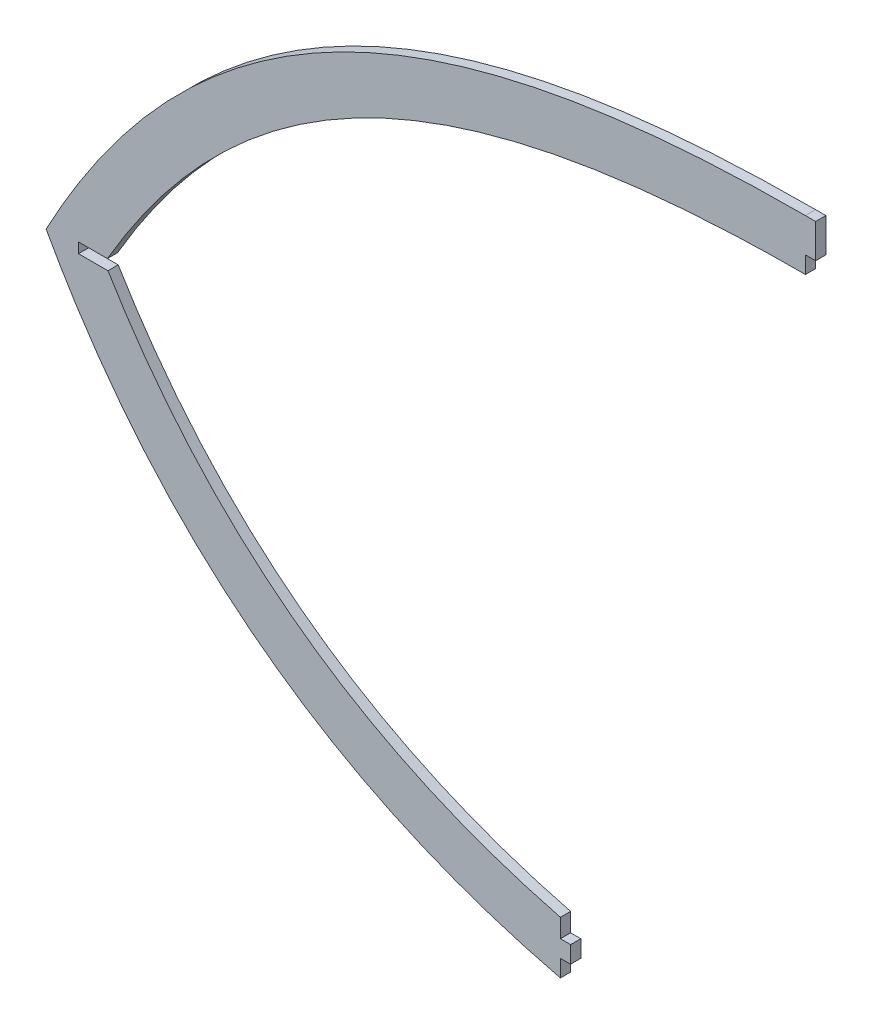
ISO-10303-21;
HEADER;
FILE_DESCRIPTION(('STEP AP214'),'2;1');
FILE_NAME('part.step','',(''),(''),'','','');
FILE_SCHEMA(('AUTOMOTIVE_DESIGN { 1 0 10303 214 1 1 1 1 }'));
ENDSEC;
DATA;
#1=APPLICATION_CONTEXT('core data for automotive mechanical design processes');
#2=APPLICATION_PROTOCOL_DEFINITION('international standard','automotive_design',2000,#1);
#3=PRODUCT_CONTEXT('',#1,'mechanical');
#4=PRODUCT('Part','Part','',(#3));
#5=PRODUCT_RELATED_PRODUCT_CATEGORY('part','',(#4));
#6=PRODUCT_DEFINITION_FORMATION('','',#4);
#7=PRODUCT_DEFINITION_CONTEXT('part definition',#1,'design');
#8=PRODUCT_DEFINITION('design','',#6,#7);
#9=PRODUCT_DEFINITION_SHAPE('','',#8);
#10=(LENGTH_UNIT() NAMED_UNIT(*) SI_UNIT(.MILLI.,.METRE.));
#11=(NAMED_UNIT(*) PLANE_ANGLE_UNIT() SI_UNIT($,.RADIAN.));
#12=(NAMED_UNIT(*) SI_UNIT($,.STERADIAN.) SOLID_ANGLE_UNIT());
#13=UNCERTAINTY_MEASURE_WITH_UNIT(LENGTH_MEASURE(1.E-05),#10,'distance_accuracy_value','');
#14=(GEOMETRIC_REPRESENTATION_CONTEXT(3) GLOBAL_UNCERTAINTY_ASSIGNED_CONTEXT((#13)) GLOBAL_UNIT_ASSIGNED_CONTEXT((#10,
#11,#12)) REPRESENTATION_CONTEXT('',''));
#15=CARTESIAN_POINT('',(0.,0.,0.));
#16=DIRECTION('',(0.,0.,1.));
#17=DIRECTION('',(1.,0.,0.));
#18=AXIS2_PLACEMENT_3D('',#15,#16,#17);
#19=CARTESIAN_POINT('',(-82.9999999999987,160.499999999998,1.5));
#20=DIRECTION('',(3.51570624464633E-13,1.,0.));
#21=DIRECTION('',(-1.,3.51570624464633E-13,0.));
#22=AXIS2_PLACEMENT_3D('',#19,#20,#21);
#23=PLANE('',#22);
#24=DIRECTION('',(1.,-3.51570624464633E-13,0.));
#25=VECTOR('',#24,1.);
#26=CARTESIAN_POINT('',(-82.9999999999987,160.499999999998,-1.5));
#27=LINE('',#26,#25);
#28=CARTESIAN_POINT('',(-82.9999999999987,160.499999999998,-1.5));
#29=VERTEX_POINT('',#28);
#30=CARTESIAN_POINT('',(-79.9999999999987,160.499999999996,-1.5));
#31=VERTEX_POINT('',#30);
#32=EDGE_CURVE('E317',#29,#31,#27,.T.);
#33=ORIENTED_EDGE('',*,*,#32,.F.);
#34=DIRECTION('',(0.,0.,-1.));
#35=VECTOR('',#34,1.);
#36=CARTESIAN_POINT('',(-82.9999999999987,160.499999999998,1.5));
#37=LINE('',#36,#35);
#38=CARTESIAN_POINT('',(-82.9999999999987,160.499999999998,1.5));
#39=VERTEX_POINT('',#38);
#40=EDGE_CURVE('E11',#39,#29,#37,.T.);
#41=ORIENTED_EDGE('',*,*,#40,.F.);
#42=DIRECTION('',(1.,-3.51570624464633E-13,0.));
#43=VECTOR('',#42,1.);
#44=CARTESIAN_POINT('',(-82.9999999999987,160.499999999998,1.5));
#45=LINE('',#44,#43);
#46=CARTESIAN_POINT('',(-79.9999999999987,160.499999999996,1.5));
#47=VERTEX_POINT('',#46);
#48=EDGE_CURVE('E367',#39,#47,#45,.T.);
#49=ORIENTED_EDGE('',*,*,#48,.T.);
#50=DIRECTION('',(0.,0.,-1.));
#51=VECTOR('',#50,1.);
#52=CARTESIAN_POINT('',(-79.9999999999987,160.499999999996,1.5));
#53=LINE('',#52,#51);
#54=EDGE_CURVE('E39',#47,#31,#53,.T.);
#55=ORIENTED_EDGE('',*,*,#54,.T.);
#56=EDGE_LOOP('',(#33,#41,#49,#55));
#57=FACE_BOUND('',#56,.T.);
#58=ADVANCED_FACE('F36',(#57),#23,.T.);
#59=CARTESIAN_POINT('',(-82.9999999999987,160.499999999998,1.5));
#60=CARTESIAN_POINT('',(-186.674882327718,160.499999999998,1.5));
#61=CARTESIAN_POINT('',(-259.899625942539,132.369993049377,1.5));
#62=CARTESIAN_POINT('',(-306.089272366091,45.5,1.5));
#63=B_SPLINE_CURVE_WITH_KNOTS('',3,(#59,#60,#61,#62),.UNSPECIFIED.,.F.,.F.,(4,4),(0.,1.),.UNSPECIFIED.);
#64=DIRECTION('',(0.,0.,-1.));
#65=VECTOR('',#64,1.);
#66=SURFACE_OF_LINEAR_EXTRUSION('',#63,#65);
#67=CARTESIAN_POINT('',(-82.9999999999987,160.499999999998,-1.5));
#68=CARTESIAN_POINT('',(-186.674882327718,160.499999999998,-1.5));
#69=CARTESIAN_POINT('',(-259.899625942539,132.369993049377,-1.5));
#70=CARTESIAN_POINT('',(-306.089272366091,45.5,-1.5));
#71=B_SPLINE_CURVE_WITH_KNOTS('',3,(#67,#68,#69,#70),.UNSPECIFIED.,.F.,.F.,(4,4),(0.,1.),.UNSPECIFIED.);
#72=CARTESIAN_POINT('',(-306.089272366091,45.5,-1.5));
#73=VERTEX_POINT('',#72);
#74=EDGE_CURVE('E361',#29,#73,#71,.T.);
#75=ORIENTED_EDGE('',*,*,#74,.T.);
#76=DIRECTION('',(0.,0.,-1.));
#77=VECTOR('',#76,1.);
#78=CARTESIAN_POINT('',(-306.089272366091,45.5,1.5));
#79=LINE('',#78,#77);
#80=CARTESIAN_POINT('',(-306.089272366091,45.5,1.5));
#81=VERTEX_POINT('',#80);
#82=EDGE_CURVE('E45',#81,#73,#79,.T.);
#83=ORIENTED_EDGE('',*,*,#82,.F.);
#84=EDGE_CURVE('E174',#39,#81,#63,.T.);
#85=ORIENTED_EDGE('',*,*,#84,.F.);
#86=ORIENTED_EDGE('',*,*,#40,.T.);
#87=EDGE_LOOP('',(#75,#83,#85,#86));
#88=FACE_BOUND('',#87,.T.);
#89=ADVANCED_FACE('F192',(#88),#66,.F.);
#90=CARTESIAN_POINT('',(628121.002682427,778166.550529546,1.5));
#91=CARTESIAN_POINT('',(-612218.711743108,-790905.456057483,1.5));
#92=CARTESIAN_POINT('',(595337.457003845,803534.153447199,1.5));
#93=B_SPLINE_CURVE_WITH_KNOTS('',2,(#90,#91,#92),.UNSPECIFIED.,.F.,.F.,(3,3),(0.,1.),.UNSPECIFIED.);
#94=DIRECTION('',(0.,0.,-1.));
#95=VECTOR('',#94,1.);
#96=SURFACE_OF_LINEAR_EXTRUSION('',#93,#95);
#97=CARTESIAN_POINT('',(628121.002682427,778166.550529546,-1.5));
#98=CARTESIAN_POINT('',(-612218.711743108,-790905.456057483,-1.5));
#99=CARTESIAN_POINT('',(595337.457003845,803534.153447199,-1.5));
#100=B_SPLINE_CURVE_WITH_KNOTS('',2,(#97,#98,#99),.UNSPECIFIED.,.F.,.F.,(3,3),(0.,1.),.UNSPECIFIED.);
#101=CARTESIAN_POINT('',(-154.999999929144,-69.5000000170487,-1.5));
#102=VERTEX_POINT('',#101);
#103=EDGE_CURVE('E159',#102,#73,#100,.T.);
#104=ORIENTED_EDGE('',*,*,#103,.F.);
#105=DIRECTION('',(0.,0.,-1.));
#106=VECTOR('',#105,1.);
#107=CARTESIAN_POINT('',(-154.999999929144,-69.5000000170487,1.5));
#108=LINE('',#107,#106);
#109=CARTESIAN_POINT('',(-154.999999929144,-69.5000000170487,1.5));
#110=VERTEX_POINT('',#109);
#111=EDGE_CURVE('E153',#110,#102,#108,.T.);
#112=ORIENTED_EDGE('',*,*,#111,.F.);
#113=EDGE_CURVE('E157',#110,#81,#93,.T.);
#114=ORIENTED_EDGE('',*,*,#113,.T.);
#115=ORIENTED_EDGE('',*,*,#82,.T.);
#116=EDGE_LOOP('',(#104,#112,#114,#115));
#117=FACE_BOUND('',#116,.T.);
#118=ADVANCED_FACE('F155',(#117),#96,.T.);
#119=CARTESIAN_POINT('',(-154.999999999998,-69.4999999999994,1.5));
#120=DIRECTION('',(-1.,1.66223645958752E-08,0.));
#121=DIRECTION('',(-1.66223645958752E-08,-1.,0.));
#122=AXIS2_PLACEMENT_3D('',#119,#120,#121);
#123=PLANE('',#122);
#124=DIRECTION('',(1.66223645958752E-08,1.,0.));
#125=VECTOR('',#124,1.);
#126=CARTESIAN_POINT('',(-154.999999999998,-69.4999999999994,-1.5));
#127=LINE('',#126,#125);
#128=CARTESIAN_POINT('',(-154.999999916886,-64.4999999999994,-1.5));
#129=VERTEX_POINT('',#128);
#130=EDGE_CURVE('E356',#102,#129,#127,.T.);
#131=ORIENTED_EDGE('',*,*,#130,.T.);
#132=DIRECTION('',(0.,0.,-1.));
#133=VECTOR('',#132,1.);
#134=CARTESIAN_POINT('',(-154.999999916886,-64.4999999999994,1.5));
#135=LINE('',#134,#133);
#136=CARTESIAN_POINT('',(-154.999999916886,-64.4999999999994,1.5));
#137=VERTEX_POINT('',#136);
#138=EDGE_CURVE('E162',#137,#129,#135,.T.);
#139=ORIENTED_EDGE('',*,*,#138,.F.);
#140=DIRECTION('',(1.66223645958752E-08,1.,0.));
#141=VECTOR('',#140,1.);
#142=CARTESIAN_POINT('',(-154.999999999998,-69.4999999999994,1.5));
#143=LINE('',#142,#141);
#144=EDGE_CURVE('E165',#110,#137,#143,.T.);
#145=ORIENTED_EDGE('',*,*,#144,.F.);
#146=ORIENTED_EDGE('',*,*,#111,.T.);
#147=EDGE_LOOP('',(#131,#139,#145,#146));
#148=FACE_BOUND('',#147,.T.);
#149=ADVANCED_FACE('F166',(#148),#123,.F.);
#150=CARTESIAN_POINT('',(-154.999999916886,-64.4999999999994,1.5));
#151=DIRECTION('',(0.,1.,0.));
#152=DIRECTION('',(-1.,0.,0.));
#153=AXIS2_PLACEMENT_3D('',#150,#151,#152);
#154=PLANE('',#153);
#155=DIRECTION('',(1.,0.,0.));
#156=VECTOR('',#155,1.);
#157=CARTESIAN_POINT('',(-154.999999916886,-64.4999999999994,-1.5));
#158=LINE('',#157,#156);
#159=CARTESIAN_POINT('',(-151.999999999998,-64.4999999999994,-1.5));
#160=VERTEX_POINT('',#159);
#161=EDGE_CURVE('E241',#129,#160,#158,.T.);
#162=ORIENTED_EDGE('',*,*,#161,.T.);
#163=DIRECTION('',(0.,0.,-1.));
#164=VECTOR('',#163,1.);
#165=CARTESIAN_POINT('',(-151.999999999998,-64.4999999999994,1.5));
#166=LINE('',#165,#164);
#167=CARTESIAN_POINT('',(-151.999999999998,-64.4999999999994,1.5));
#168=VERTEX_POINT('',#167);
#169=EDGE_CURVE('E239',#168,#160,#166,.T.);
#170=ORIENTED_EDGE('',*,*,#169,.F.);
#171=DIRECTION('',(1.,0.,0.));
#172=VECTOR('',#171,1.);
#173=CARTESIAN_POINT('',(-154.999999916886,-64.4999999999994,1.5));
#174=LINE('',#173,#172);
#175=EDGE_CURVE('E170',#137,#168,#174,.T.);
#176=ORIENTED_EDGE('',*,*,#175,.F.);
#177=ORIENTED_EDGE('',*,*,#138,.T.);
#178=EDGE_LOOP('',(#162,#170,#176,#177));
#179=FACE_BOUND('',#178,.T.);
#180=ADVANCED_FACE('F196',(#179),#154,.F.);
#181=CARTESIAN_POINT('',(-151.999999999998,-64.4999999999994,1.5));
#182=DIRECTION('',(-1.,0.,0.));
#183=DIRECTION('',(0.,-1.,0.));
#184=AXIS2_PLACEMENT_3D('',#181,#182,#183);
#185=PLANE('',#184);
#186=DIRECTION('',(0.,1.,0.));
#187=VECTOR('',#186,1.);
#188=CARTESIAN_POINT('',(-151.999999999998,-64.4999999999994,-1.5));
#189=LINE('',#188,#187);
#190=CARTESIAN_POINT('',(-151.999999999998,-59.4999999999994,-1.5));
#191=VERTEX_POINT('',#190);
#192=EDGE_CURVE('E247',#160,#191,#189,.T.);
#193=ORIENTED_EDGE('',*,*,#192,.T.);
#194=DIRECTION('',(0.,0.,-1.));
#195=VECTOR('',#194,1.);
#196=CARTESIAN_POINT('',(-151.999999999998,-59.4999999999994,1.5));
#197=LINE('',#196,#195);
#198=CARTESIAN_POINT('',(-151.999999999998,-59.4999999999994,1.5));
#199=VERTEX_POINT('',#198);
#200=EDGE_CURVE('E243',#199,#191,#197,.T.);
#201=ORIENTED_EDGE('',*,*,#200,.F.);
#202=DIRECTION('',(0.,1.,0.));
#203=VECTOR('',#202,1.);
#204=CARTESIAN_POINT('',(-151.999999999998,-64.4999999999994,1.5));
#205=LINE('',#204,#203);
#206=EDGE_CURVE('E234',#168,#199,#205,.T.);
#207=ORIENTED_EDGE('',*,*,#206,.F.);
#208=ORIENTED_EDGE('',*,*,#169,.T.);
#209=EDGE_LOOP('',(#193,#201,#207,#208));
#210=FACE_BOUND('',#209,.T.);
#211=ADVANCED_FACE('F199',(#210),#185,.F.);
#212=CARTESIAN_POINT('',(-151.999999999998,-59.4999999999994,1.5));
#213=DIRECTION('',(0.,-1.,0.));
#214=DIRECTION('',(0.,0.,-1.));
#215=AXIS2_PLACEMENT_3D('',#212,#213,#214);
#216=PLANE('',#215);
#217=DIRECTION('',(-1.,0.,0.));
#218=VECTOR('',#217,1.);
#219=CARTESIAN_POINT('',(-151.999999999998,-59.4999999999994,-1.5));
#220=LINE('',#219,#218);
#221=CARTESIAN_POINT('',(-154.999999916887,-59.4999999999994,-1.5));
#222=VERTEX_POINT('',#221);
#223=EDGE_CURVE('E352',#191,#222,#220,.T.);
#224=ORIENTED_EDGE('',*,*,#223,.T.);
#225=DIRECTION('',(0.,0.,-1.));
#226=VECTOR('',#225,1.);
#227=CARTESIAN_POINT('',(-154.999999916887,-59.4999999999994,1.5));
#228=LINE('',#227,#226);
#229=CARTESIAN_POINT('',(-154.999999916887,-59.4999999999994,1.5));
#230=VERTEX_POINT('',#229);
#231=EDGE_CURVE('E249',#230,#222,#228,.T.);
#232=ORIENTED_EDGE('',*,*,#231,.F.);
#233=DIRECTION('',(-1.,0.,0.));
#234=VECTOR('',#233,1.);
#235=CARTESIAN_POINT('',(-151.999999999998,-59.4999999999994,1.5));
#236=LINE('',#235,#234);
#237=EDGE_CURVE('E232',#199,#230,#236,.T.);
#238=ORIENTED_EDGE('',*,*,#237,.F.);
#239=ORIENTED_EDGE('',*,*,#200,.T.);
#240=EDGE_LOOP('',(#224,#232,#238,#239));
#241=FACE_BOUND('',#240,.T.);
#242=ADVANCED_FACE('F203',(#241),#216,.F.);
#243=CARTESIAN_POINT('',(-154.999999916887,-59.4999999999994,1.5));
#244=DIRECTION('',(-1.,2.80011243323957E-12,0.));
#245=DIRECTION('',(-2.80011243323957E-12,-1.,0.));
#246=AXIS2_PLACEMENT_3D('',#243,#244,#245);
#247=PLANE('',#246);
#248=DIRECTION('',(2.80011243323957E-12,1.,0.));
#249=VECTOR('',#248,1.);
#250=CARTESIAN_POINT('',(-154.999999916887,-59.4999999999994,-1.5));
#251=LINE('',#250,#249);
#252=CARTESIAN_POINT('',(-154.999999916871,-54.0482308469535,-1.5));
#253=VERTEX_POINT('',#252);
#254=EDGE_CURVE('E261',#222,#253,#251,.T.);
#255=ORIENTED_EDGE('',*,*,#254,.T.);
#256=DIRECTION('',(0.,0.,-1.));
#257=VECTOR('',#256,1.);
#258=CARTESIAN_POINT('',(-154.999999916871,-54.0482308469535,1.5));
#259=LINE('',#258,#257);
#260=CARTESIAN_POINT('',(-154.999999916871,-54.0482308469535,1.5));
#261=VERTEX_POINT('',#260);
#262=EDGE_CURVE('E259',#261,#253,#259,.T.);
#263=ORIENTED_EDGE('',*,*,#262,.F.);
#264=DIRECTION('',(2.80011243323957E-12,1.,0.));
#265=VECTOR('',#264,1.);
#266=CARTESIAN_POINT('',(-154.999999916887,-59.4999999999994,1.5));
#267=LINE('',#266,#265);
#268=EDGE_CURVE('E225',#230,#261,#267,.T.);
#269=ORIENTED_EDGE('',*,*,#268,.F.);
#270=ORIENTED_EDGE('',*,*,#231,.T.);
#271=EDGE_LOOP('',(#255,#263,#269,#270));
#272=FACE_BOUND('',#271,.T.);
#273=ADVANCED_FACE('F207',(#272),#247,.F.);
#274=CARTESIAN_POINT('',(-151.496713822991,-54.9148990615622,1.5));
#275=CARTESIAN_POINT('',(-153.398834262126,-54.4580166378309,1.5));
#276=CARTESIAN_POINT('',(-157.208567120412,-53.4984048576572,1.5));
#277=CARTESIAN_POINT('',(-164.660096697761,-51.4419935318653,1.5));
#278=CARTESIAN_POINT('',(-173.748419645787,-48.5940055598413,1.5));
#279=CARTESIAN_POINT('',(-184.26927531825,-44.7413254498893,1.5));
#280=CARTESIAN_POINT('',(-197.799833821469,-39.0240238482658,1.5));
#281=CARTESIAN_POINT('',(-213.78961101986,-30.7928618903945,1.5));
#282=CARTESIAN_POINT('',(-231.549414252278,-19.1756565135875,1.5));
#283=CARTESIAN_POINT('',(-247.929177810818,-5.79714362559889,1.5));
#284=CARTESIAN_POINT('',(-260.462024810725,6.84921209286295,1.5));
#285=CARTESIAN_POINT('',(-269.83072194683,17.8876076715245,1.5));
#286=CARTESIAN_POINT('',(-276.528937944344,26.6313311327526,1.5));
#287=CARTESIAN_POINT('',(-281.840598342277,34.3146395086273,1.5));
#288=CARTESIAN_POINT('',(-285.921125934865,40.6909740668219,1.5));
#289=CARTESIAN_POINT('',(-287.916086448758,43.974755214365,1.5));
#290=CARTESIAN_POINT('',(-288.890968436563,45.6216431758552,1.5));
#291=B_SPLINE_CURVE_WITH_KNOTS('',3,(#274,#275,#276,#277,#278,#279,#280,#281,#282,#283,#284,
#285,#286,#287,#288,#289,#290),.UNSPECIFIED.,.F.,.F.,(4,1,1,1,1,1,1,1,1,1,1,1,1,1,4),
(0.497668508711325,0.497805621376866,0.497942734042408,0.49821695937349,0.498491184704572,
0.498765410035654,0.499313860697819,0.499862311359984,0.500410762022148,0.500959212684313,
0.501233438015395,0.501507663346477,0.50178188867756,0.501919001343101,0.502056114008642),.UNSPECIFIED.);
#292=DIRECTION('',(0.,0.,-1.));
#293=VECTOR('',#292,1.);
#294=SURFACE_OF_LINEAR_EXTRUSION('',#291,#293);
#295=CARTESIAN_POINT('',(-151.496713822991,-54.9148990615622,-1.5));
#296=CARTESIAN_POINT('',(-153.398834262126,-54.4580166378309,-1.5));
#297=CARTESIAN_POINT('',(-157.208567120412,-53.4984048576572,-1.5));
#298=CARTESIAN_POINT('',(-164.660096697761,-51.4419935318653,-1.5));
#299=CARTESIAN_POINT('',(-173.748419645787,-48.5940055598413,-1.5));
#300=CARTESIAN_POINT('',(-184.26927531825,-44.7413254498893,-1.5));
#301=CARTESIAN_POINT('',(-197.799833821469,-39.0240238482658,-1.5));
#302=CARTESIAN_POINT('',(-213.78961101986,-30.7928618903945,-1.5));
#303=CARTESIAN_POINT('',(-231.549414252278,-19.1756565135875,-1.5));
#304=CARTESIAN_POINT('',(-247.929177810818,-5.79714362559889,-1.5));
#305=CARTESIAN_POINT('',(-260.462024810725,6.84921209286295,-1.5));
#306=CARTESIAN_POINT('',(-269.83072194683,17.8876076715245,-1.5));
#307=CARTESIAN_POINT('',(-276.528937944344,26.6313311327526,-1.5));
#308=CARTESIAN_POINT('',(-281.840598342277,34.3146395086273,-1.5));
#309=CARTESIAN_POINT('',(-285.921125934865,40.6909740668219,-1.5));
#310=CARTESIAN_POINT('',(-287.916086448758,43.974755214365,-1.5));
#311=CARTESIAN_POINT('',(-288.890968436563,45.6216431758552,-1.5));
#312=B_SPLINE_CURVE_WITH_KNOTS('',3,(#295,#296,#297,#298,#299,#300,#301,#302,#303,#304,#305,
#306,#307,#308,#309,#310,#311),.UNSPECIFIED.,.F.,.F.,(4,1,1,1,1,1,1,1,1,1,1,1,1,1,4),
(0.497668508711325,0.497805621376866,0.497942734042408,0.49821695937349,0.498491184704572,
0.498765410035654,0.499313860697819,0.499862311359984,0.500410762022148,0.500959212684313,
0.501233438015395,0.501507663346477,0.50178188867756,0.501919001343101,0.502056114008642),.UNSPECIFIED.);
#313=CARTESIAN_POINT('',(-287.922750115386,44.0000001015957,-1.5));
#314=VERTEX_POINT('',#313);
#315=EDGE_CURVE('E267',#253,#314,#312,.T.);
#316=ORIENTED_EDGE('',*,*,#315,.T.);
#317=DIRECTION('',(0.,0.,-1.));
#318=VECTOR('',#317,1.);
#319=CARTESIAN_POINT('',(-287.922750115386,44.0000001015957,1.5));
#320=LINE('',#319,#318);
#321=CARTESIAN_POINT('',(-287.922750115386,44.0000001015957,1.5));
#322=VERTEX_POINT('',#321);
#323=EDGE_CURVE('E264',#322,#314,#320,.T.);
#324=ORIENTED_EDGE('',*,*,#323,.F.);
#325=EDGE_CURVE('E219',#261,#322,#291,.T.);
#326=ORIENTED_EDGE('',*,*,#325,.F.);
#327=ORIENTED_EDGE('',*,*,#262,.T.);
#328=EDGE_LOOP('',(#316,#324,#326,#327));
#329=FACE_BOUND('',#328,.T.);
#330=ADVANCED_FACE('F211',(#329),#294,.F.);
#331=CARTESIAN_POINT('',(-296.59523714137,43.9999999999978,1.5));
#332=DIRECTION('',(-1.17149555039174E-08,1.,0.));
#333=DIRECTION('',(-1.,-1.17149555039174E-08,0.));
#334=AXIS2_PLACEMENT_3D('',#331,#332,#333);
#335=PLANE('',#334);
#336=DIRECTION('',(1.,1.17149555039174E-08,0.));
#337=VECTOR('',#336,1.);
#338=CARTESIAN_POINT('',(-296.59523714137,43.9999999999978,-1.5));
#339=LINE('',#338,#337);
#340=CARTESIAN_POINT('',(-296.59523714137,43.9999999999978,-1.5));
#341=VERTEX_POINT('',#340);
#342=EDGE_CURVE('E343',#341,#314,#339,.T.);
#343=ORIENTED_EDGE('',*,*,#342,.F.);
#344=DIRECTION('',(0.,0.,-1.));
#345=VECTOR('',#344,1.);
#346=CARTESIAN_POINT('',(-296.59523714137,43.9999999999978,1.5));
#347=LINE('',#346,#345);
#348=CARTESIAN_POINT('',(-296.59523714137,43.9999999999978,1.5));
#349=VERTEX_POINT('',#348);
#350=EDGE_CURVE('E271',#349,#341,#347,.T.);
#351=ORIENTED_EDGE('',*,*,#350,.F.);
#352=DIRECTION('',(1.,1.17149555039174E-08,0.));
#353=VECTOR('',#352,1.);
#354=CARTESIAN_POINT('',(-296.59523714137,43.9999999999978,1.5));
#355=LINE('',#354,#353);
#356=EDGE_CURVE('E226',#349,#322,#355,.T.);
#357=ORIENTED_EDGE('',*,*,#356,.T.);
#358=ORIENTED_EDGE('',*,*,#323,.T.);
#359=EDGE_LOOP('',(#343,#351,#357,#358));
#360=FACE_BOUND('',#359,.T.);
#361=ADVANCED_FACE('F216',(#360),#335,.T.);
#362=CARTESIAN_POINT('',(-296.59523714137,46.9999999999978,1.5));
#363=DIRECTION('',(1.,0.,0.));
#364=DIRECTION('',(0.,0.,-1.));
#365=AXIS2_PLACEMENT_3D('',#362,#363,#364);
#366=PLANE('',#365);
#367=DIRECTION('',(0.,-1.,0.));
#368=VECTOR('',#367,1.);
#369=CARTESIAN_POINT('',(-296.59523714137,46.9999999999978,-1.5));
#370=LINE('',#369,#368);
#371=CARTESIAN_POINT('',(-296.59523714137,46.9999999999978,-1.5));
#372=VERTEX_POINT('',#371);
#373=EDGE_CURVE('E340',#372,#341,#370,.T.);
#374=ORIENTED_EDGE('',*,*,#373,.F.);
#375=DIRECTION('',(0.,0.,-1.));
#376=VECTOR('',#375,1.);
#377=CARTESIAN_POINT('',(-296.59523714137,46.9999999999978,1.5));
#378=LINE('',#377,#376);
#379=CARTESIAN_POINT('',(-296.59523714137,46.9999999999978,1.5));
#380=VERTEX_POINT('',#379);
#381=EDGE_CURVE('E376',#380,#372,#378,.T.);
#382=ORIENTED_EDGE('',*,*,#381,.F.);
#383=DIRECTION('',(0.,-1.,0.));
#384=VECTOR('',#383,1.);
#385=CARTESIAN_POINT('',(-296.59523714137,46.9999999999978,1.5));
#386=LINE('',#385,#384);
#387=EDGE_CURVE('E275',#380,#349,#386,.T.);
#388=ORIENTED_EDGE('',*,*,#387,.T.);
#389=ORIENTED_EDGE('',*,*,#350,.T.);
#390=EDGE_LOOP('',(#374,#382,#388,#389));
#391=FACE_BOUND('',#390,.T.);
#392=ADVANCED_FACE('F427',(#391),#366,.T.);
#393=CARTESIAN_POINT('',(-288.095237154737,46.9999999769957,1.5));
#394=DIRECTION('',(-2.70613434048006E-09,-1.,0.));
#395=DIRECTION('',(1.,-2.70613434048006E-09,0.));
#396=AXIS2_PLACEMENT_3D('',#393,#394,#395);
#397=PLANE('',#396);
#398=DIRECTION('',(-1.,2.70613434048007E-09,0.));
#399=VECTOR('',#398,1.);
#400=CARTESIAN_POINT('',(-288.095237154737,46.9999999769957,-1.5));
#401=LINE('',#400,#399);
#402=CARTESIAN_POINT('',(-288.095237154737,46.9999999769957,-1.5));
#403=VERTEX_POINT('',#402);
#404=EDGE_CURVE('E334',#403,#372,#401,.T.);
#405=ORIENTED_EDGE('',*,*,#404,.F.);
#406=DIRECTION('',(0.,0.,-1.));
#407=VECTOR('',#406,1.);
#408=CARTESIAN_POINT('',(-288.095237154737,46.9999999769957,1.5));
#409=LINE('',#408,#407);
#410=CARTESIAN_POINT('',(-288.095237154737,46.9999999769957,1.5));
#411=VERTEX_POINT('',#410);
#412=EDGE_CURVE('E378',#411,#403,#409,.T.);
#413=ORIENTED_EDGE('',*,*,#412,.F.);
#414=DIRECTION('',(-1.,2.70613434048007E-09,0.));
#415=VECTOR('',#414,1.);
#416=CARTESIAN_POINT('',(-288.095237154737,46.9999999769957,1.5));
#417=LINE('',#416,#415);
#418=EDGE_CURVE('E276',#411,#380,#417,.T.);
#419=ORIENTED_EDGE('',*,*,#418,.T.);
#420=ORIENTED_EDGE('',*,*,#381,.T.);
#421=EDGE_LOOP('',(#405,#413,#419,#420));
#422=FACE_BOUND('',#421,.T.);
#423=ADVANCED_FACE('F297',(#422),#397,.T.);
#424=CARTESIAN_POINT('',(-288.890961696319,45.6216775852373,1.5));
#425=CARTESIAN_POINT('',(-288.211850872264,46.8067881507705,1.5));
#426=CARTESIAN_POINT('',(-286.827427737221,49.1771120972746,1.5));
#427=CARTESIAN_POINT('',(-284.033163215721,53.7809606733059,1.5));
#428=CARTESIAN_POINT('',(-280.456285194431,59.3452556651562,1.5));
#429=CARTESIAN_POINT('',(-276.04120271178,65.7050809140456,1.5));
#430=CARTESIAN_POINT('',(-269.986323751837,73.7792557607451,1.5));
#431=CARTESIAN_POINT('',(-262.103230601763,83.1282887761167,1.5));
#432=CARTESIAN_POINT('',(-252.129618635627,93.224737965267,1.5));
#433=CARTESIAN_POINT('',(-241.62350402886,102.265557437588,1.5));
#434=CARTESIAN_POINT('',(-226.869996314777,112.996706949626,1.5));
#435=CARTESIAN_POINT('',(-206.950555637531,124.077346442406,1.5));
#436=CARTESIAN_POINT('',(-184.837171479751,132.347826811712,1.5));
#437=CARTESIAN_POINT('',(-165.731650341535,137.402296078479,1.5));
#438=CARTESIAN_POINT('',(-150.681267399754,140.438783995058,1.5));
#439=CARTESIAN_POINT('',(-134.899304097584,142.748069929424,1.5));
#440=CARTESIAN_POINT('',(-121.133674992198,144.089731656609,1.5));
#441=CARTESIAN_POINT('',(-109.751009886276,144.828271883604,1.5));
#442=CARTESIAN_POINT('',(-101.030099250297,145.218691459708,1.5));
#443=CARTESIAN_POINT('',(-93.605076867095,145.411133998353,1.5));
#444=CARTESIAN_POINT('',(-87.5801987156483,145.487406491515,1.5));
#445=CARTESIAN_POINT('',(-84.5230175360336,145.500000166355,1.5));
#446=CARTESIAN_POINT('',(-82.9999999999988,145.499999999997,1.5));
#447=B_SPLINE_CURVE_WITH_KNOTS('',3,(#424,#425,#426,#427,#428,#429,#430,#431,#432,#433,#434,
#435,#436,#437,#438,#439,#440,#441,#442,#443,#444,#445,#446),.UNSPECIFIED.,.F.,.F.,(4,1,1,1,1,1,
1,1,1,1,1,1,1,1,1,1,1,1,1,1,4),(0.,0.0151613101496384,0.0303226202992767,0.0606452405985534,
0.09096786089783,0.121290481197107,0.18193572179566,0.242580962394213,0.303226202992767,
0.36387144359132,0.485161924788427,0.606452405985534,0.667097646584087,0.72774288718264,
0.788388127781193,0.849033368379747,0.879355988679024,0.9096786089783,0.940001229277577,
0.955162539427215,0.970323849576854),.UNSPECIFIED.);
#448=DIRECTION('',(0.,0.,-1.));
#449=VECTOR('',#448,1.);
#450=SURFACE_OF_LINEAR_EXTRUSION('',#447,#449);
#451=CARTESIAN_POINT('',(-288.890961696319,45.6216775852373,-1.5));
#452=CARTESIAN_POINT('',(-288.211850872264,46.8067881507705,-1.5));
#453=CARTESIAN_POINT('',(-286.827427737221,49.1771120972746,-1.5));
#454=CARTESIAN_POINT('',(-284.033163215721,53.7809606733059,-1.5));
#455=CARTESIAN_POINT('',(-280.456285194431,59.3452556651562,-1.5));
#456=CARTESIAN_POINT('',(-276.04120271178,65.7050809140456,-1.5));
#457=CARTESIAN_POINT('',(-269.986323751837,73.7792557607451,-1.5));
#458=CARTESIAN_POINT('',(-262.103230601763,83.1282887761167,-1.5));
#459=CARTESIAN_POINT('',(-252.129618635627,93.224737965267,-1.5));
#460=CARTESIAN_POINT('',(-241.62350402886,102.265557437588,-1.5));
#461=CARTESIAN_POINT('',(-226.869996314777,112.996706949626,-1.5));
#462=CARTESIAN_POINT('',(-206.950555637531,124.077346442406,-1.5));
#463=CARTESIAN_POINT('',(-184.837171479751,132.347826811712,-1.5));
#464=CARTESIAN_POINT('',(-165.731650341535,137.402296078479,-1.5));
#465=CARTESIAN_POINT('',(-150.681267399754,140.438783995058,-1.5));
#466=CARTESIAN_POINT('',(-134.899304097584,142.748069929424,-1.5));
#467=CARTESIAN_POINT('',(-121.133674992198,144.089731656609,-1.5));
#468=CARTESIAN_POINT('',(-109.751009886276,144.828271883604,-1.5));
#469=CARTESIAN_POINT('',(-101.030099250297,145.218691459708,-1.5));
#470=CARTESIAN_POINT('',(-93.605076867095,145.411133998353,-1.5));
#471=CARTESIAN_POINT('',(-87.5801987156483,145.487406491515,-1.5));
#472=CARTESIAN_POINT('',(-84.5230175360336,145.500000166355,-1.5));
#473=CARTESIAN_POINT('',(-82.9999999999988,145.499999999997,-1.5));
#474=B_SPLINE_CURVE_WITH_KNOTS('',3,(#451,#452,#453,#454,#455,#456,#457,#458,#459,#460,#461,
#462,#463,#464,#465,#466,#467,#468,#469,#470,#471,#472,#473),.UNSPECIFIED.,.F.,.F.,(4,1,1,1,1,1,
1,1,1,1,1,1,1,1,1,1,1,1,1,1,4),(0.,0.0151613101496384,0.0303226202992767,0.0606452405985534,
0.09096786089783,0.121290481197107,0.18193572179566,0.242580962394213,0.303226202992767,
0.36387144359132,0.485161924788427,0.606452405985534,0.667097646584087,0.72774288718264,
0.788388127781193,0.849033368379747,0.879355988679024,0.9096786089783,0.940001229277577,
0.955162539427215,0.970323849576854),.UNSPECIFIED.);
#475=CARTESIAN_POINT('',(-82.9999999999988,145.499999999997,-1.5));
#476=VERTEX_POINT('',#475);
#477=EDGE_CURVE('E329',#403,#476,#474,.T.);
#478=ORIENTED_EDGE('',*,*,#477,.T.);
#479=DIRECTION('',(0.,0.,-1.));
#480=VECTOR('',#479,1.);
#481=CARTESIAN_POINT('',(-82.9999999999988,145.499999999997,1.5));
#482=LINE('',#481,#480);
#483=CARTESIAN_POINT('',(-82.9999999999988,145.499999999997,1.5));
#484=VERTEX_POINT('',#483);
#485=EDGE_CURVE('E380',#484,#476,#482,.T.);
#486=ORIENTED_EDGE('',*,*,#485,.F.);
#487=EDGE_CURVE('E279',#411,#484,#447,.T.);
#488=ORIENTED_EDGE('',*,*,#487,.F.);
#489=ORIENTED_EDGE('',*,*,#412,.T.);
#490=EDGE_LOOP('',(#478,#486,#488,#489));
#491=FACE_BOUND('',#490,.T.);
#492=ADVANCED_FACE('F292',(#491),#450,.F.);
#493=CARTESIAN_POINT('',(-82.9999999999965,150.499999999994,1.5));
#494=DIRECTION('',(1.,-4.52415882535047E-13,0.));
#495=DIRECTION('',(4.52415882535047E-13,1.,0.));
#496=AXIS2_PLACEMENT_3D('',#493,#494,#495);
#497=PLANE('',#496);
#498=DIRECTION('',(-4.52415882535047E-13,-1.,0.));
#499=VECTOR('',#498,1.);
#500=CARTESIAN_POINT('',(-82.9999999999965,150.499999999994,-1.5));
#501=LINE('',#500,#499);
#502=CARTESIAN_POINT('',(-82.9999999999965,150.499999999994,-1.5));
#503=VERTEX_POINT('',#502);
#504=EDGE_CURVE('E326',#503,#476,#501,.T.);
#505=ORIENTED_EDGE('',*,*,#504,.F.);
#506=DIRECTION('',(0.,0.,-1.));
#507=VECTOR('',#506,1.);
#508=CARTESIAN_POINT('',(-82.9999999999965,150.499999999994,1.5));
#509=LINE('',#508,#507);
#510=CARTESIAN_POINT('',(-82.9999999999965,150.499999999994,1.5));
#511=VERTEX_POINT('',#510);
#512=EDGE_CURVE('E382',#511,#503,#509,.T.);
#513=ORIENTED_EDGE('',*,*,#512,.F.);
#514=DIRECTION('',(-4.52415882535047E-13,-1.,0.));
#515=VECTOR('',#514,1.);
#516=CARTESIAN_POINT('',(-82.9999999999965,150.499999999994,1.5));
#517=LINE('',#516,#515);
#518=EDGE_CURVE('E286',#511,#484,#517,.T.);
#519=ORIENTED_EDGE('',*,*,#518,.T.);
#520=ORIENTED_EDGE('',*,*,#485,.T.);
#521=EDGE_LOOP('',(#505,#513,#519,#520));
#522=FACE_BOUND('',#521,.T.);
#523=ADVANCED_FACE('F296',(#522),#497,.T.);
#524=CARTESIAN_POINT('',(-82.9999999999965,150.499999999994,1.5));
#525=DIRECTION('',(0.,1.,0.));
#526=DIRECTION('',(0.,0.,1.));
#527=AXIS2_PLACEMENT_3D('',#524,#525,#526);
#528=PLANE('',#527);
#529=DIRECTION('',(1.,0.,0.));
#530=VECTOR('',#529,1.);
#531=CARTESIAN_POINT('',(-82.9999999999965,150.499999999994,-1.5));
#532=LINE('',#531,#530);
#533=CARTESIAN_POINT('',(-79.9999999999965,150.499999999994,-1.5));
#534=VERTEX_POINT('',#533);
#535=EDGE_CURVE('E321',#503,#534,#532,.T.);
#536=ORIENTED_EDGE('',*,*,#535,.T.);
#537=DIRECTION('',(0.,0.,-1.));
#538=VECTOR('',#537,1.);
#539=CARTESIAN_POINT('',(-79.9999999999965,150.499999999994,1.5));
#540=LINE('',#539,#538);
#541=CARTESIAN_POINT('',(-79.9999999999965,150.499999999994,1.5));
#542=VERTEX_POINT('',#541);
#543=EDGE_CURVE('E383',#542,#534,#540,.T.);
#544=ORIENTED_EDGE('',*,*,#543,.F.);
#545=DIRECTION('',(1.,0.,0.));
#546=VECTOR('',#545,1.);
#547=CARTESIAN_POINT('',(-82.9999999999965,150.499999999994,1.5));
#548=LINE('',#547,#546);
#549=EDGE_CURVE('E507',#511,#542,#548,.T.);
#550=ORIENTED_EDGE('',*,*,#549,.F.);
#551=ORIENTED_EDGE('',*,*,#512,.T.);
#552=EDGE_LOOP('',(#536,#544,#550,#551));
#553=FACE_BOUND('',#552,.T.);
#554=ADVANCED_FACE('F301',(#553),#528,.F.);
#555=CARTESIAN_POINT('',(-79.9999999999987,160.499999999996,1.5));
#556=DIRECTION('',(1.,2.22044604924982E-13,0.));
#557=DIRECTION('',(-2.22044604924982E-13,1.,0.));
#558=AXIS2_PLACEMENT_3D('',#555,#556,#557);
#559=PLANE('',#558);
#560=DIRECTION('',(2.22044604924982E-13,-1.,0.));
#561=VECTOR('',#560,1.);
#562=CARTESIAN_POINT('',(-79.9999999999987,160.499999999996,-1.5));
#563=LINE('',#562,#561);
#564=EDGE_CURVE('E320',#31,#534,#563,.T.);
#565=ORIENTED_EDGE('',*,*,#564,.F.);
#566=ORIENTED_EDGE('',*,*,#54,.F.);
#567=DIRECTION('',(2.22044604924982E-13,-1.,0.));
#568=VECTOR('',#567,1.);
#569=CARTESIAN_POINT('',(-79.9999999999987,160.499999999996,1.5));
#570=LINE('',#569,#568);
#571=EDGE_CURVE('E385',#47,#542,#570,.T.);
#572=ORIENTED_EDGE('',*,*,#571,.T.);
#573=ORIENTED_EDGE('',*,*,#543,.T.);
#574=EDGE_LOOP('',(#565,#566,#572,#573));
#575=FACE_BOUND('',#574,.T.);
#576=ADVANCED_FACE('F304',(#575),#559,.T.);
#577=CARTESIAN_POINT('',(-206.511766941425,123.515314617711,1.5));
#578=DIRECTION('',(0.,0.,1.));
#579=DIRECTION('',(1.,0.,0.));
#580=AXIS2_PLACEMENT_3D('',#577,#578,#579);
#581=PLANE('',#580);
#582=ORIENTED_EDGE('',*,*,#48,.F.);
#583=ORIENTED_EDGE('',*,*,#84,.T.);
#584=ORIENTED_EDGE('',*,*,#113,.F.);
#585=ORIENTED_EDGE('',*,*,#144,.T.);
#586=ORIENTED_EDGE('',*,*,#175,.T.);
#587=ORIENTED_EDGE('',*,*,#206,.T.);
#588=ORIENTED_EDGE('',*,*,#237,.T.);
#589=ORIENTED_EDGE('',*,*,#268,.T.);
#590=ORIENTED_EDGE('',*,*,#325,.T.);
#591=ORIENTED_EDGE('',*,*,#356,.F.);
#592=ORIENTED_EDGE('',*,*,#387,.F.);
#593=ORIENTED_EDGE('',*,*,#418,.F.);
#594=ORIENTED_EDGE('',*,*,#487,.T.);
#595=ORIENTED_EDGE('',*,*,#518,.F.);
#596=ORIENTED_EDGE('',*,*,#549,.T.);
#597=ORIENTED_EDGE('',*,*,#571,.F.);
#598=EDGE_LOOP('',(#582,#583,#584,#585,#586,#587,#588,#589,#590,#591,#592,#593,#594,#595,#596,#597));
#599=FACE_BOUND('',#598,.T.);
#600=ADVANCED_FACE('F173',(#599),#581,.T.);
#601=CARTESIAN_POINT('',(-206.511766941425,123.515314617711,-1.5));
#602=DIRECTION('',(0.,0.,1.));
#603=DIRECTION('',(1.,0.,0.));
#604=AXIS2_PLACEMENT_3D('',#601,#602,#603);
#605=PLANE('',#604);
#606=ORIENTED_EDGE('',*,*,#32,.T.);
#607=ORIENTED_EDGE('',*,*,#564,.T.);
#608=ORIENTED_EDGE('',*,*,#535,.F.);
#609=ORIENTED_EDGE('',*,*,#504,.T.);
#610=ORIENTED_EDGE('',*,*,#477,.F.);
#611=ORIENTED_EDGE('',*,*,#404,.T.);
#612=ORIENTED_EDGE('',*,*,#373,.T.);
#613=ORIENTED_EDGE('',*,*,#342,.T.);
#614=ORIENTED_EDGE('',*,*,#315,.F.);
#615=ORIENTED_EDGE('',*,*,#254,.F.);
#616=ORIENTED_EDGE('',*,*,#223,.F.);
#617=ORIENTED_EDGE('',*,*,#192,.F.);
#618=ORIENTED_EDGE('',*,*,#161,.F.);
#619=ORIENTED_EDGE('',*,*,#130,.F.);
#620=ORIENTED_EDGE('',*,*,#103,.T.);
#621=ORIENTED_EDGE('',*,*,#74,.F.);
#622=EDGE_LOOP('',(#606,#607,#608,#609,#610,#611,#612,#613,#614,#615,#616,#617,#618,#619,#620,#621));
#623=FACE_BOUND('',#622,.T.);
#624=ADVANCED_FACE('F310',(#623),#605,.F.);
#625=CLOSED_SHELL('',(#58,#89,#118,#149,#180,#211,#242,#273,#330,#361,#392,#423,#492,#523,#554,
#576,#600,#624));
#626=MANIFOLD_SOLID_BREP('B2',#625);
#627=ADVANCED_BREP_SHAPE_REPRESENTATION('',(#18,#626),#14);
#628=SHAPE_DEFINITION_REPRESENTATION(#9,#627);
ENDSEC;
END-ISO-10303-21;
